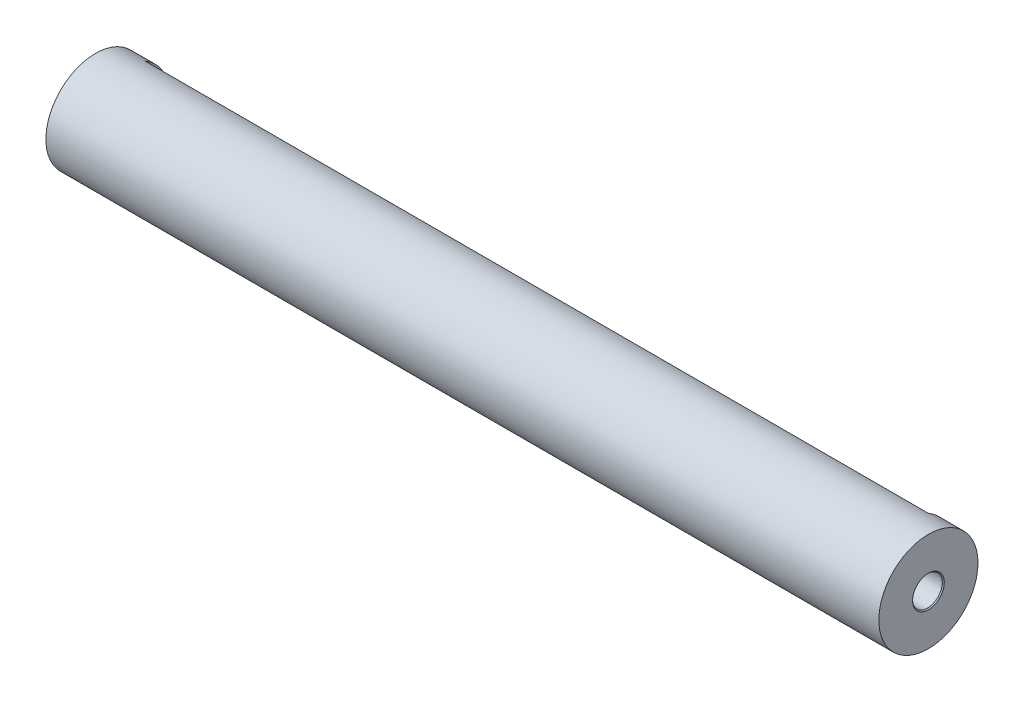
ISO-10303-21;
HEADER;
FILE_DESCRIPTION(('STEP AP214'),'2;1');
FILE_NAME('part.step','',(''),(''),'','','');
FILE_SCHEMA(('AUTOMOTIVE_DESIGN { 1 0 10303 214 1 1 1 1 }'));
ENDSEC;
DATA;
#1=APPLICATION_CONTEXT('core data for automotive mechanical design processes');
#2=APPLICATION_PROTOCOL_DEFINITION('international standard','automotive_design',2000,#1);
#3=PRODUCT_CONTEXT('',#1,'mechanical');
#4=PRODUCT('Part','Part','',(#3));
#5=PRODUCT_RELATED_PRODUCT_CATEGORY('part','',(#4));
#6=PRODUCT_DEFINITION_FORMATION('','',#4);
#7=PRODUCT_DEFINITION_CONTEXT('part definition',#1,'design');
#8=PRODUCT_DEFINITION('design','',#6,#7);
#9=PRODUCT_DEFINITION_SHAPE('','',#8);
#10=(LENGTH_UNIT() NAMED_UNIT(*) SI_UNIT(.MILLI.,.METRE.));
#11=(NAMED_UNIT(*) PLANE_ANGLE_UNIT() SI_UNIT($,.RADIAN.));
#12=(NAMED_UNIT(*) SI_UNIT($,.STERADIAN.) SOLID_ANGLE_UNIT());
#13=UNCERTAINTY_MEASURE_WITH_UNIT(LENGTH_MEASURE(1.E-05),#10,'distance_accuracy_value','');
#14=(GEOMETRIC_REPRESENTATION_CONTEXT(3) GLOBAL_UNCERTAINTY_ASSIGNED_CONTEXT((#13)) GLOBAL_UNIT_ASSIGNED_CONTEXT((#10,
#11,#12)) REPRESENTATION_CONTEXT('',''));
#15=CARTESIAN_POINT('',(0.,0.,0.));
#16=DIRECTION('',(0.,0.,1.));
#17=DIRECTION('',(1.,0.,0.));
#18=AXIS2_PLACEMENT_3D('',#15,#16,#17);
#19=CARTESIAN_POINT('',(84.,0.,0.));
#20=DIRECTION('',(-1.,0.,0.));
#21=DIRECTION('',(0.,0.,1.));
#22=AXIS2_PLACEMENT_3D('',#19,#20,#21);
#23=CYLINDRICAL_SURFACE('',#22,5.);
#24=CARTESIAN_POINT('',(0.,0.,0.));
#25=DIRECTION('',(1.,0.,0.));
#26=DIRECTION('',(0.,0.,-1.));
#27=AXIS2_PLACEMENT_3D('',#24,#25,#26);
#28=CIRCLE('',#27,5.);
#29=CARTESIAN_POINT('',(0.,0.,-5.));
#30=VERTEX_POINT('',#29);
#31=EDGE_CURVE('E78',#30,#30,#28,.T.);
#32=ORIENTED_EDGE('',*,*,#31,.T.);
#33=EDGE_LOOP('',(#32));
#34=FACE_BOUND('',#33,.T.);
#35=CARTESIAN_POINT('',(84.,0.,0.));
#36=DIRECTION('',(1.,0.,0.));
#37=DIRECTION('',(0.,0.,-1.));
#38=AXIS2_PLACEMENT_3D('',#35,#36,#37);
#39=CIRCLE('',#38,5.);
#40=CARTESIAN_POINT('',(84.,0.,-5.));
#41=VERTEX_POINT('',#40);
#42=EDGE_CURVE('E67',#41,#41,#39,.T.);
#43=ORIENTED_EDGE('',*,*,#42,.F.);
#44=EDGE_LOOP('',(#43));
#45=FACE_BOUND('',#44,.T.);
#46=CARTESIAN_POINT('',(81.5,0.,0.));
#47=DIRECTION('',(-1.,0.,0.));
#48=DIRECTION('',(0.,0.,1.));
#49=AXIS2_PLACEMENT_3D('',#46,#47,#48);
#50=CIRCLE('',#49,5.);
#51=CARTESIAN_POINT('',(81.5,4.33012701892219,-2.5));
#52=VERTEX_POINT('',#51);
#53=CARTESIAN_POINT('',(81.5,-4.33012701892219,-2.5));
#54=VERTEX_POINT('',#53);
#55=EDGE_CURVE('E11',#52,#54,#50,.T.);
#56=ORIENTED_EDGE('',*,*,#55,.F.);
#57=DIRECTION('',(-1.,0.,0.));
#58=VECTOR('',#57,1.);
#59=CARTESIAN_POINT('',(84.,4.33012701892219,-2.5));
#60=LINE('',#59,#58);
#61=CARTESIAN_POINT('',(2.5,4.33012701892219,-2.5));
#62=VERTEX_POINT('',#61);
#63=EDGE_CURVE('E40',#52,#62,#60,.T.);
#64=ORIENTED_EDGE('',*,*,#63,.T.);
#65=CARTESIAN_POINT('',(2.5,0.,0.));
#66=DIRECTION('',(-1.,0.,0.));
#67=DIRECTION('',(0.,0.,1.));
#68=AXIS2_PLACEMENT_3D('',#65,#66,#67);
#69=CIRCLE('',#68,5.);
#70=CARTESIAN_POINT('',(2.5,-4.33012701892219,-2.5));
#71=VERTEX_POINT('',#70);
#72=EDGE_CURVE('E61',#62,#71,#69,.T.);
#73=ORIENTED_EDGE('',*,*,#72,.T.);
#74=DIRECTION('',(-1.,0.,0.));
#75=VECTOR('',#74,1.);
#76=CARTESIAN_POINT('',(84.,-4.33012701892219,-2.5));
#77=LINE('',#76,#75);
#78=EDGE_CURVE('E66',#71,#54,#77,.F.);
#79=ORIENTED_EDGE('',*,*,#78,.T.);
#80=EDGE_LOOP('',(#56,#64,#73,#79));
#81=FACE_BOUND('',#80,.T.);
#82=ADVANCED_FACE('F33',(#34,#45,#81),#23,.T.);
#83=CARTESIAN_POINT('',(84.,0.,0.));
#84=DIRECTION('',(1.,0.,0.));
#85=DIRECTION('',(0.,0.,-1.));
#86=AXIS2_PLACEMENT_3D('',#83,#84,#85);
#87=PLANE('',#86);
#88=CARTESIAN_POINT('',(84.,0.,0.));
#89=DIRECTION('',(1.,0.,0.));
#90=DIRECTION('',(0.,0.,-1.));
#91=AXIS2_PLACEMENT_3D('',#88,#89,#90);
#92=CIRCLE('',#91,1.6);
#93=CARTESIAN_POINT('',(84.,0.,-1.6));
#94=VERTEX_POINT('',#93);
#95=EDGE_CURVE('E110',#94,#94,#92,.T.);
#96=ORIENTED_EDGE('',*,*,#95,.F.);
#97=EDGE_LOOP('',(#96));
#98=FACE_BOUND('',#97,.T.);
#99=ORIENTED_EDGE('',*,*,#42,.T.);
#100=EDGE_LOOP('',(#99));
#101=FACE_BOUND('',#100,.T.);
#102=ADVANCED_FACE('F128',(#98,#101),#87,.T.);
#103=CARTESIAN_POINT('',(0.,0.,0.));
#104=DIRECTION('',(1.,0.,0.));
#105=DIRECTION('',(0.,0.,-1.));
#106=AXIS2_PLACEMENT_3D('',#103,#104,#105);
#107=PLANE('',#106);
#108=CARTESIAN_POINT('',(0.,0.,0.));
#109=DIRECTION('',(-1.,0.,0.));
#110=DIRECTION('',(0.,0.,1.));
#111=AXIS2_PLACEMENT_3D('',#108,#109,#110);
#112=CIRCLE('',#111,1.6);
#113=CARTESIAN_POINT('',(0.,0.,1.6));
#114=VERTEX_POINT('',#113);
#115=EDGE_CURVE('E95',#114,#114,#112,.T.);
#116=ORIENTED_EDGE('',*,*,#115,.F.);
#117=EDGE_LOOP('',(#116));
#118=FACE_BOUND('',#117,.T.);
#119=ORIENTED_EDGE('',*,*,#31,.F.);
#120=EDGE_LOOP('',(#119));
#121=FACE_BOUND('',#120,.T.);
#122=ADVANCED_FACE('F133',(#118,#121),#107,.F.);
#123=CARTESIAN_POINT('',(12.,0.,0.));
#124=DIRECTION('',(-1.,0.,0.));
#125=DIRECTION('',(0.,0.,1.));
#126=AXIS2_PLACEMENT_3D('',#123,#124,#125);
#127=CONICAL_SURFACE('',#126,1.25,1.02974425867665);
#128=CARTESIAN_POINT('',(12.7510757737845,0.,0.));
#129=VERTEX_POINT('',#128);
#130=VERTEX_LOOP('',#129);
#131=FACE_BOUND('',#130,.T.);
#132=CARTESIAN_POINT('',(12.,0.,0.));
#133=DIRECTION('',(-1.,0.,0.));
#134=DIRECTION('',(0.,0.,1.));
#135=AXIS2_PLACEMENT_3D('',#132,#133,#134);
#136=CIRCLE('',#135,1.25);
#137=CARTESIAN_POINT('',(12.,0.,1.25));
#138=VERTEX_POINT('',#137);
#139=EDGE_CURVE('E81',#138,#138,#136,.T.);
#140=ORIENTED_EDGE('',*,*,#139,.T.);
#141=EDGE_LOOP('',(#140));
#142=FACE_BOUND('',#141,.T.);
#143=ADVANCED_FACE('F142',(#131,#142),#127,.F.);
#144=CARTESIAN_POINT('',(0.,0.,0.));
#145=DIRECTION('',(-1.,0.,0.));
#146=DIRECTION('',(0.,0.,1.));
#147=AXIS2_PLACEMENT_3D('',#144,#145,#146);
#148=CYLINDRICAL_SURFACE('',#147,1.25);
#149=ORIENTED_EDGE('',*,*,#139,.F.);
#150=EDGE_LOOP('',(#149));
#151=FACE_BOUND('',#150,.T.);
#152=CARTESIAN_POINT('',(9.,0.,0.));
#153=DIRECTION('',(-1.,0.,0.));
#154=DIRECTION('',(0.,0.,1.));
#155=AXIS2_PLACEMENT_3D('',#152,#153,#154);
#156=CIRCLE('',#155,1.25);
#157=CARTESIAN_POINT('',(9.,0.,1.25));
#158=VERTEX_POINT('',#157);
#159=EDGE_CURVE('E86',#158,#158,#156,.T.);
#160=ORIENTED_EDGE('',*,*,#159,.T.);
#161=EDGE_LOOP('',(#160));
#162=FACE_BOUND('',#161,.T.);
#163=ADVANCED_FACE('F147',(#151,#162),#148,.F.);
#164=CARTESIAN_POINT('',(9.,1.25,0.));
#165=DIRECTION('',(1.,0.,0.));
#166=DIRECTION('',(0.,0.,-1.));
#167=AXIS2_PLACEMENT_3D('',#164,#165,#166);
#168=PLANE('',#167);
#169=ORIENTED_EDGE('',*,*,#159,.F.);
#170=EDGE_LOOP('',(#169));
#171=FACE_BOUND('',#170,.T.);
#172=CARTESIAN_POINT('',(9.,0.,0.));
#173=DIRECTION('',(-1.,0.,0.));
#174=DIRECTION('',(0.,0.,1.));
#175=AXIS2_PLACEMENT_3D('',#172,#173,#174);
#176=CIRCLE('',#175,1.5);
#177=CARTESIAN_POINT('',(9.,0.,1.5));
#178=VERTEX_POINT('',#177);
#179=EDGE_CURVE('E89',#178,#178,#176,.T.);
#180=ORIENTED_EDGE('',*,*,#179,.T.);
#181=EDGE_LOOP('',(#180));
#182=FACE_BOUND('',#181,.T.);
#183=ADVANCED_FACE('F153',(#171,#182),#168,.F.);
#184=CARTESIAN_POINT('',(0.,0.,0.));
#185=DIRECTION('',(-1.,0.,0.));
#186=DIRECTION('',(0.,0.,1.));
#187=AXIS2_PLACEMENT_3D('',#184,#185,#186);
#188=CYLINDRICAL_SURFACE('',#187,1.5);
#189=ORIENTED_EDGE('',*,*,#179,.F.);
#190=EDGE_LOOP('',(#189));
#191=FACE_BOUND('',#190,.T.);
#192=CARTESIAN_POINT('',(0.0999999999999993,0.,0.));
#193=DIRECTION('',(-1.,0.,0.));
#194=DIRECTION('',(0.,0.,1.));
#195=AXIS2_PLACEMENT_3D('',#192,#193,#194);
#196=CIRCLE('',#195,1.5);
#197=CARTESIAN_POINT('',(0.0999999999999993,0.,1.5));
#198=VERTEX_POINT('',#197);
#199=EDGE_CURVE('E92',#198,#198,#196,.T.);
#200=ORIENTED_EDGE('',*,*,#199,.T.);
#201=EDGE_LOOP('',(#200));
#202=FACE_BOUND('',#201,.T.);
#203=ADVANCED_FACE('F157',(#191,#202),#188,.F.);
#204=CARTESIAN_POINT('',(0.,0.,0.));
#205=DIRECTION('',(-1.,0.,0.));
#206=DIRECTION('',(0.,0.,1.));
#207=AXIS2_PLACEMENT_3D('',#204,#205,#206);
#208=CONICAL_SURFACE('',#207,1.6,0.78539816339744);
#209=ORIENTED_EDGE('',*,*,#199,.F.);
#210=EDGE_LOOP('',(#209));
#211=FACE_BOUND('',#210,.T.);
#212=ORIENTED_EDGE('',*,*,#115,.T.);
#213=EDGE_LOOP('',(#212));
#214=FACE_BOUND('',#213,.T.);
#215=ADVANCED_FACE('F161',(#211,#214),#208,.F.);
#216=CARTESIAN_POINT('',(72.,0.,0.));
#217=DIRECTION('',(1.,0.,0.));
#218=DIRECTION('',(0.,0.,-1.));
#219=AXIS2_PLACEMENT_3D('',#216,#217,#218);
#220=CONICAL_SURFACE('',#219,1.25,1.02974425867665);
#221=CARTESIAN_POINT('',(71.2489242262155,0.,0.));
#222=VERTEX_POINT('',#221);
#223=VERTEX_LOOP('',#222);
#224=FACE_BOUND('',#223,.T.);
#225=CARTESIAN_POINT('',(72.,0.,0.));
#226=DIRECTION('',(1.,0.,0.));
#227=DIRECTION('',(0.,0.,-1.));
#228=AXIS2_PLACEMENT_3D('',#225,#226,#227);
#229=CIRCLE('',#228,1.25);
#230=CARTESIAN_POINT('',(72.,0.,-1.25));
#231=VERTEX_POINT('',#230);
#232=EDGE_CURVE('E98',#231,#231,#229,.T.);
#233=ORIENTED_EDGE('',*,*,#232,.T.);
#234=EDGE_LOOP('',(#233));
#235=FACE_BOUND('',#234,.T.);
#236=ADVANCED_FACE('F165',(#224,#235),#220,.F.);
#237=CARTESIAN_POINT('',(84.,0.,0.));
#238=DIRECTION('',(1.,0.,0.));
#239=DIRECTION('',(0.,0.,-1.));
#240=AXIS2_PLACEMENT_3D('',#237,#238,#239);
#241=CYLINDRICAL_SURFACE('',#240,1.25);
#242=ORIENTED_EDGE('',*,*,#232,.F.);
#243=EDGE_LOOP('',(#242));
#244=FACE_BOUND('',#243,.T.);
#245=CARTESIAN_POINT('',(75.,0.,0.));
#246=DIRECTION('',(1.,0.,0.));
#247=DIRECTION('',(0.,0.,-1.));
#248=AXIS2_PLACEMENT_3D('',#245,#246,#247);
#249=CIRCLE('',#248,1.25);
#250=CARTESIAN_POINT('',(75.,0.,-1.25));
#251=VERTEX_POINT('',#250);
#252=EDGE_CURVE('E101',#251,#251,#249,.T.);
#253=ORIENTED_EDGE('',*,*,#252,.T.);
#254=EDGE_LOOP('',(#253));
#255=FACE_BOUND('',#254,.T.);
#256=ADVANCED_FACE('F169',(#244,#255),#241,.F.);
#257=CARTESIAN_POINT('',(75.,1.25,0.));
#258=DIRECTION('',(-1.,0.,0.));
#259=DIRECTION('',(0.,0.,1.));
#260=AXIS2_PLACEMENT_3D('',#257,#258,#259);
#261=PLANE('',#260);
#262=ORIENTED_EDGE('',*,*,#252,.F.);
#263=EDGE_LOOP('',(#262));
#264=FACE_BOUND('',#263,.T.);
#265=CARTESIAN_POINT('',(75.,0.,0.));
#266=DIRECTION('',(1.,0.,0.));
#267=DIRECTION('',(0.,0.,-1.));
#268=AXIS2_PLACEMENT_3D('',#265,#266,#267);
#269=CIRCLE('',#268,1.49999999999999);
#270=CARTESIAN_POINT('',(75.,0.,-1.49999999999999));
#271=VERTEX_POINT('',#270);
#272=EDGE_CURVE('E104',#271,#271,#269,.T.);
#273=ORIENTED_EDGE('',*,*,#272,.T.);
#274=EDGE_LOOP('',(#273));
#275=FACE_BOUND('',#274,.T.);
#276=ADVANCED_FACE('F173',(#264,#275),#261,.F.);
#277=CARTESIAN_POINT('',(84.,0.,0.));
#278=DIRECTION('',(1.,0.,0.));
#279=DIRECTION('',(0.,0.,-1.));
#280=AXIS2_PLACEMENT_3D('',#277,#278,#279);
#281=CYLINDRICAL_SURFACE('',#280,1.49999999999999);
#282=ORIENTED_EDGE('',*,*,#272,.F.);
#283=EDGE_LOOP('',(#282));
#284=FACE_BOUND('',#283,.T.);
#285=CARTESIAN_POINT('',(83.9,0.,0.));
#286=DIRECTION('',(1.,0.,0.));
#287=DIRECTION('',(0.,0.,-1.));
#288=AXIS2_PLACEMENT_3D('',#285,#286,#287);
#289=CIRCLE('',#288,1.49999999999999);
#290=CARTESIAN_POINT('',(83.9,0.,-1.49999999999999));
#291=VERTEX_POINT('',#290);
#292=EDGE_CURVE('E107',#291,#291,#289,.T.);
#293=ORIENTED_EDGE('',*,*,#292,.T.);
#294=EDGE_LOOP('',(#293));
#295=FACE_BOUND('',#294,.T.);
#296=ADVANCED_FACE('F123',(#284,#295),#281,.F.);
#297=CARTESIAN_POINT('',(84.,0.,0.));
#298=DIRECTION('',(1.,0.,0.));
#299=DIRECTION('',(0.,0.,-1.));
#300=AXIS2_PLACEMENT_3D('',#297,#298,#299);
#301=CONICAL_SURFACE('',#300,1.6,0.785398163397466);
#302=ORIENTED_EDGE('',*,*,#292,.F.);
#303=EDGE_LOOP('',(#302));
#304=FACE_BOUND('',#303,.T.);
#305=ORIENTED_EDGE('',*,*,#95,.T.);
#306=EDGE_LOOP('',(#305));
#307=FACE_BOUND('',#306,.T.);
#308=ADVANCED_FACE('F116',(#304,#307),#301,.F.);
#309=CARTESIAN_POINT('',(81.5,-5.,-6.87615111620871));
#310=DIRECTION('',(-1.,0.,0.));
#311=DIRECTION('',(0.,0.,1.));
#312=AXIS2_PLACEMENT_3D('',#309,#310,#311);
#313=PLANE('',#312);
#314=ORIENTED_EDGE('',*,*,#55,.T.);
#315=DIRECTION('',(0.,1.,0.));
#316=VECTOR('',#315,1.);
#317=CARTESIAN_POINT('',(81.5,-5.,-2.5));
#318=LINE('',#317,#316);
#319=EDGE_CURVE('E73',#54,#52,#318,.T.);
#320=ORIENTED_EDGE('',*,*,#319,.T.);
#321=EDGE_LOOP('',(#314,#320));
#322=FACE_BOUND('',#321,.T.);
#323=ADVANCED_FACE('F114',(#322),#313,.T.);
#324=CARTESIAN_POINT('',(-19.9649580602498,-5.,-2.5));
#325=DIRECTION('',(0.,0.,1.));
#326=DIRECTION('',(1.,0.,0.));
#327=AXIS2_PLACEMENT_3D('',#324,#325,#326);
#328=PLANE('',#327);
#329=ORIENTED_EDGE('',*,*,#319,.F.);
#330=ORIENTED_EDGE('',*,*,#78,.F.);
#331=DIRECTION('',(0.,1.,0.));
#332=VECTOR('',#331,1.);
#333=CARTESIAN_POINT('',(2.5,-5.,-2.5));
#334=LINE('',#333,#332);
#335=EDGE_CURVE('E46',#71,#62,#334,.T.);
#336=ORIENTED_EDGE('',*,*,#335,.T.);
#337=ORIENTED_EDGE('',*,*,#63,.F.);
#338=EDGE_LOOP('',(#329,#330,#336,#337));
#339=FACE_BOUND('',#338,.T.);
#340=ADVANCED_FACE('F71',(#339),#328,.F.);
#341=CARTESIAN_POINT('',(2.5,-5.,-6.87615111620871));
#342=DIRECTION('',(-1.,0.,0.));
#343=DIRECTION('',(0.,0.,1.));
#344=AXIS2_PLACEMENT_3D('',#341,#342,#343);
#345=PLANE('',#344);
#346=ORIENTED_EDGE('',*,*,#335,.F.);
#347=ORIENTED_EDGE('',*,*,#72,.F.);
#348=EDGE_LOOP('',(#346,#347));
#349=FACE_BOUND('',#348,.T.);
#350=ADVANCED_FACE('F62',(#349),#345,.F.);
#351=CLOSED_SHELL('',(#82,#102,#122,#143,#163,#183,#203,#215,#236,#256,#276,#296,#308,#323,#340,#350));
#352=MANIFOLD_SOLID_BREP('B2',#351);
#353=ADVANCED_BREP_SHAPE_REPRESENTATION('',(#18,#352),#14);
#354=SHAPE_DEFINITION_REPRESENTATION(#9,#353);
ENDSEC;
END-ISO-10303-21;
